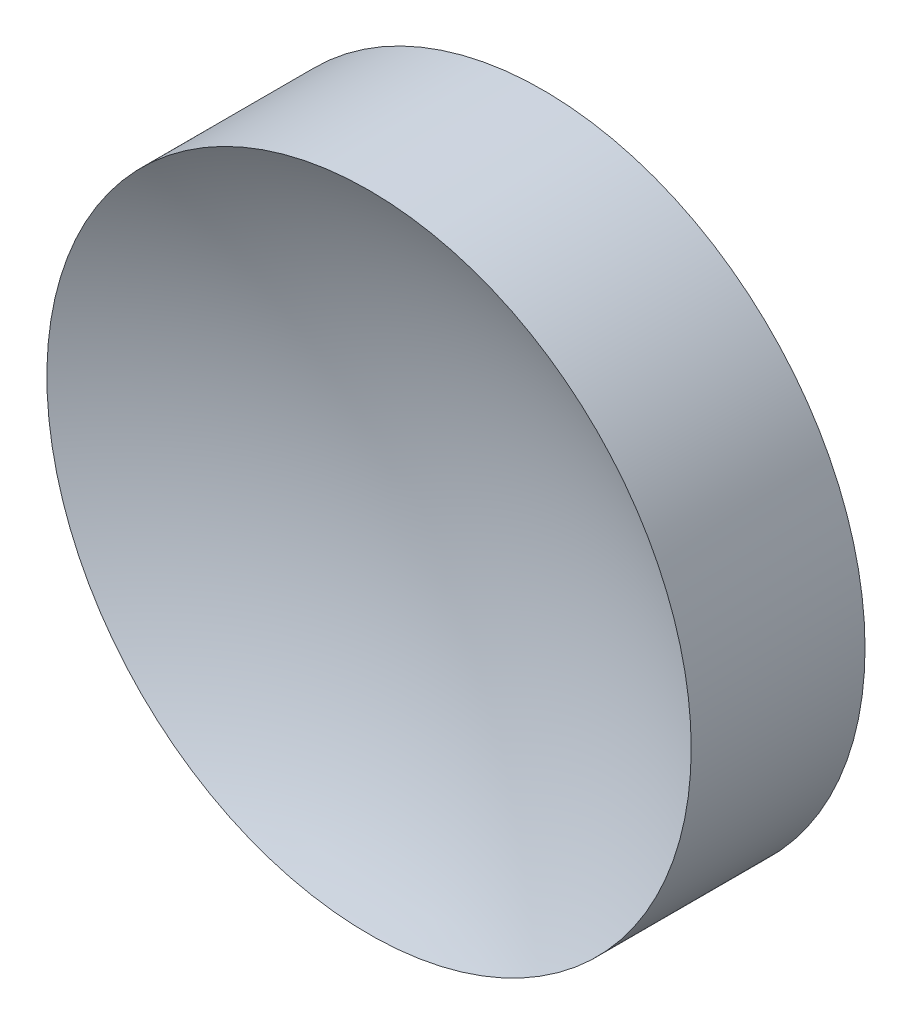
ISO-10303-21;
HEADER;
FILE_DESCRIPTION(('STEP AP214'),'2;1');
FILE_NAME('part.step','',(''),(''),'','','');
FILE_SCHEMA(('AUTOMOTIVE_DESIGN { 1 0 10303 214 1 1 1 1 }'));
ENDSEC;
DATA;
#1=APPLICATION_CONTEXT('core data for automotive mechanical design processes');
#2=APPLICATION_PROTOCOL_DEFINITION('international standard','automotive_design',2000,#1);
#3=PRODUCT_CONTEXT('',#1,'mechanical');
#4=PRODUCT('Part','Part','',(#3));
#5=PRODUCT_RELATED_PRODUCT_CATEGORY('part','',(#4));
#6=PRODUCT_DEFINITION_FORMATION('','',#4);
#7=PRODUCT_DEFINITION_CONTEXT('part definition',#1,'design');
#8=PRODUCT_DEFINITION('design','',#6,#7);
#9=PRODUCT_DEFINITION_SHAPE('','',#8);
#10=(LENGTH_UNIT() NAMED_UNIT(*) SI_UNIT(.MILLI.,.METRE.));
#11=(NAMED_UNIT(*) PLANE_ANGLE_UNIT() SI_UNIT($,.RADIAN.));
#12=(NAMED_UNIT(*) SI_UNIT($,.STERADIAN.) SOLID_ANGLE_UNIT());
#13=UNCERTAINTY_MEASURE_WITH_UNIT(LENGTH_MEASURE(1.E-05),#10,'distance_accuracy_value','');
#14=(GEOMETRIC_REPRESENTATION_CONTEXT(3) GLOBAL_UNCERTAINTY_ASSIGNED_CONTEXT((#13)) GLOBAL_UNIT_ASSIGNED_CONTEXT((#10,
#11,#12)) REPRESENTATION_CONTEXT('',''));
#15=CARTESIAN_POINT('',(0.,0.,0.));
#16=DIRECTION('',(0.,0.,1.));
#17=DIRECTION('',(1.,0.,0.));
#18=AXIS2_PLACEMENT_3D('',#15,#16,#17);
#19=CARTESIAN_POINT('',(0.,0.,25.8276444546485));
#20=DIRECTION('',(0.,0.,1.));
#21=DIRECTION('',(0.,1.,0.));
#22=AXIS2_PLACEMENT_3D('',#19,#20,#21);
#23=SPHERICAL_SURFACE('',#22,25.7);
#24=CARTESIAN_POINT('',(0.,0.,3.37235554535147));
#25=DIRECTION('',(0.,0.,1.));
#26=DIRECTION('',(1.,0.,0.));
#27=AXIS2_PLACEMENT_3D('',#24,#25,#26);
#28=CIRCLE('',#27,12.5);
#29=CARTESIAN_POINT('',(12.5,0.,3.37235554535147));
#30=VERTEX_POINT('',#29);
#31=EDGE_CURVE('E18',#30,#30,#28,.T.);
#32=ORIENTED_EDGE('',*,*,#31,.T.);
#33=EDGE_LOOP('',(#32));
#34=FACE_BOUND('',#33,.T.);
#35=ADVANCED_FACE('F12',(#34),#23,.F.);
#36=CARTESIAN_POINT('',(0.,0.,-3.37235554535147));
#37=DIRECTION('',(0.,0.,1.));
#38=DIRECTION('',(1.,0.,0.));
#39=AXIS2_PLACEMENT_3D('',#36,#37,#38);
#40=PLANE('',#39);
#41=CARTESIAN_POINT('',(0.,0.,-3.37235554535147));
#42=DIRECTION('',(0.,0.,1.));
#43=DIRECTION('',(1.,0.,0.));
#44=AXIS2_PLACEMENT_3D('',#41,#42,#43);
#45=CIRCLE('',#44,12.5);
#46=CARTESIAN_POINT('',(12.5,0.,-3.37235554535147));
#47=VERTEX_POINT('',#46);
#48=EDGE_CURVE('E8',#47,#47,#45,.T.);
#49=ORIENTED_EDGE('',*,*,#48,.F.);
#50=EDGE_LOOP('',(#49));
#51=FACE_BOUND('',#50,.T.);
#52=ADVANCED_FACE('F27',(#51),#40,.F.);
#53=CARTESIAN_POINT('',(0.,0.,7.39479772507786));
#54=DIRECTION('',(0.,0.,1.));
#55=DIRECTION('',(1.,0.,0.));
#56=AXIS2_PLACEMENT_3D('',#53,#54,#55);
#57=CYLINDRICAL_SURFACE('',#56,12.5);
#58=ORIENTED_EDGE('',*,*,#31,.F.);
#59=EDGE_LOOP('',(#58));
#60=FACE_BOUND('',#59,.T.);
#61=ORIENTED_EDGE('',*,*,#48,.T.);
#62=EDGE_LOOP('',(#61));
#63=FACE_BOUND('',#62,.T.);
#64=ADVANCED_FACE('F25',(#60,#63),#57,.T.);
#65=CLOSED_SHELL('',(#35,#52,#64));
#66=MANIFOLD_SOLID_BREP('B1',#65);
#67=ADVANCED_BREP_SHAPE_REPRESENTATION('',(#18,#66),#14);
#68=SHAPE_DEFINITION_REPRESENTATION(#9,#67);
ENDSEC;
END-ISO-10303-21;
